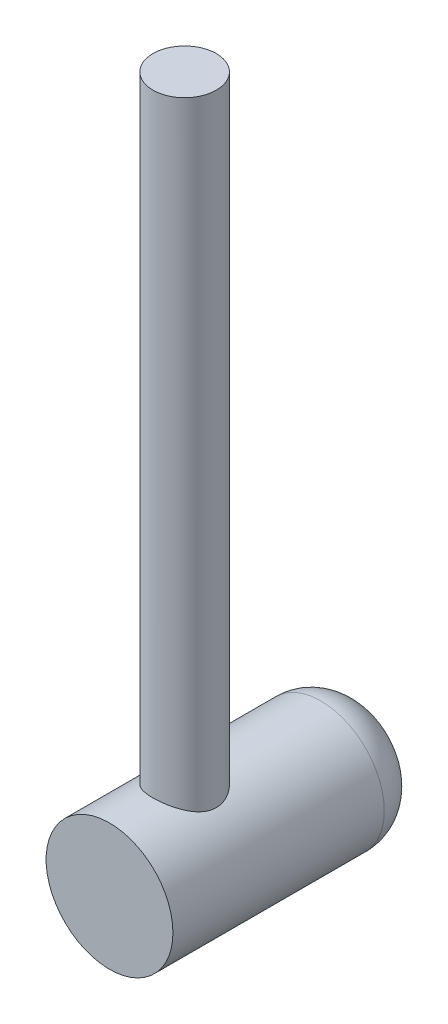
ISO-10303-21;
HEADER;
FILE_DESCRIPTION(('STEP AP214'),'2;1');
FILE_NAME('part.step','',(''),(''),'','','');
FILE_SCHEMA(('AUTOMOTIVE_DESIGN { 1 0 10303 214 1 1 1 1 }'));
ENDSEC;
DATA;
#1=APPLICATION_CONTEXT('core data for automotive mechanical design processes');
#2=APPLICATION_PROTOCOL_DEFINITION('international standard','automotive_design',2000,#1);
#3=PRODUCT_CONTEXT('',#1,'mechanical');
#4=PRODUCT('Part','Part','',(#3));
#5=PRODUCT_RELATED_PRODUCT_CATEGORY('part','',(#4));
#6=PRODUCT_DEFINITION_FORMATION('','',#4);
#7=PRODUCT_DEFINITION_CONTEXT('part definition',#1,'design');
#8=PRODUCT_DEFINITION('design','',#6,#7);
#9=PRODUCT_DEFINITION_SHAPE('','',#8);
#10=(LENGTH_UNIT() NAMED_UNIT(*) SI_UNIT(.MILLI.,.METRE.));
#11=(NAMED_UNIT(*) PLANE_ANGLE_UNIT() SI_UNIT($,.RADIAN.));
#12=(NAMED_UNIT(*) SI_UNIT($,.STERADIAN.) SOLID_ANGLE_UNIT());
#13=UNCERTAINTY_MEASURE_WITH_UNIT(LENGTH_MEASURE(1.E-05),#10,'distance_accuracy_value','');
#14=(GEOMETRIC_REPRESENTATION_CONTEXT(3) GLOBAL_UNCERTAINTY_ASSIGNED_CONTEXT((#13)) GLOBAL_UNIT_ASSIGNED_CONTEXT((#10,
#11,#12)) REPRESENTATION_CONTEXT('',''));
#15=CARTESIAN_POINT('',(0.,0.,0.));
#16=DIRECTION('',(0.,0.,1.));
#17=DIRECTION('',(1.,0.,0.));
#18=AXIS2_PLACEMENT_3D('',#15,#16,#17);
#19=CARTESIAN_POINT('',(0.,0.,3000.));
#20=DIRECTION('',(0.,0.,-1.));
#21=DIRECTION('',(-1.,0.,0.));
#22=AXIS2_PLACEMENT_3D('',#19,#20,#21);
#23=CYLINDRICAL_SURFACE('',#22,750.);
#24=CARTESIAN_POINT('',(0.,0.,500.));
#25=DIRECTION('',(0.,0.,1.));
#26=DIRECTION('',(1.,0.,0.));
#27=AXIS2_PLACEMENT_3D('',#24,#25,#26);
#28=CIRCLE('',#27,750.);
#29=CARTESIAN_POINT('',(750.,0.,500.));
#30=VERTEX_POINT('',#29);
#31=EDGE_CURVE('E58',#30,#30,#28,.T.);
#32=ORIENTED_EDGE('',*,*,#31,.T.);
#33=EDGE_LOOP('',(#32));
#34=FACE_BOUND('',#33,.T.);
#35=CARTESIAN_POINT('',(0.,0.,3000.));
#36=DIRECTION('',(0.,0.,1.));
#37=DIRECTION('',(1.,0.,0.));
#38=AXIS2_PLACEMENT_3D('',#35,#36,#37);
#39=CIRCLE('',#38,750.);
#40=CARTESIAN_POINT('',(750.,0.,3000.));
#41=VERTEX_POINT('',#40);
#42=EDGE_CURVE('E63',#41,#41,#39,.T.);
#43=ORIENTED_EDGE('',*,*,#42,.F.);
#44=EDGE_LOOP('',(#43));
#45=FACE_BOUND('',#44,.T.);
#46=CARTESIAN_POINT('',(0.,750.,1736.63545153968));
#47=CARTESIAN_POINT('',(-4.93069732081843,749.999997752163,1736.63545408549));
#48=CARTESIAN_POINT('',(-9.86148759707114,749.951347959688,1736.73272671617));
#49=CARTESIAN_POINT('',(-19.7140047015577,749.757053782446,1737.12154307044));
#50=CARTESIAN_POINT('',(-24.6357304138135,749.611398163406,1737.41310929524));
#51=CARTESIAN_POINT('',(-34.4620221164051,749.223968262609,1738.18978213098));
#52=CARTESIAN_POINT('',(-39.3665806885778,748.982156620643,1738.67496396909));
#53=CARTESIAN_POINT('',(-49.1471147245483,748.404007908838,1739.83737036177));
#54=CARTESIAN_POINT('',(-54.0230910441244,748.067673684001,1740.5145891363));
#55=CARTESIAN_POINT('',(-63.7457447260188,747.302013513661,1742.06035648772));
#56=CARTESIAN_POINT('',(-68.5923586921137,746.872531463636,1742.92922629074));
#57=CARTESIAN_POINT('',(-78.239199966597,745.923668083329,1744.85510765098));
#58=CARTESIAN_POINT('',(-83.0394268701726,745.404285969248,1745.91212084855));
#59=CARTESIAN_POINT('',(-92.5845066096782,744.278980362664,1748.211174411));
#60=CARTESIAN_POINT('',(-97.3293655958195,743.673066582924,1749.45319401048));
#61=CARTESIAN_POINT('',(-106.756269040175,742.378431089759,1752.11898125012));
#62=CARTESIAN_POINT('',(-111.438313661111,741.689709590894,1753.54274841936));
#63=CARTESIAN_POINT('',(-120.713852717281,740.236527433918,1756.56241515));
#64=CARTESIAN_POINT('',(-125.30762242963,739.472374423287,1758.15761769743));
#65=CARTESIAN_POINT('',(-134.418433173688,737.870637893333,1761.52080671211));
#66=CARTESIAN_POINT('',(-138.935474213349,737.033054381621,1763.28879316146));
#67=CARTESIAN_POINT('',(-147.886383807094,735.289336184398,1766.99349402166));
#68=CARTESIAN_POINT('',(-152.320251494869,734.383200785365,1768.93021018878));
#69=CARTESIAN_POINT('',(-161.098741795704,732.507570419064,1772.96815554796));
#70=CARTESIAN_POINT('',(-165.443364333312,731.538075398232,1775.06938487912));
#71=CARTESIAN_POINT('',(-174.036921182535,729.541366571546,1779.43165064721));
#72=CARTESIAN_POINT('',(-178.285874290465,728.514164244615,1781.69265532515));
#73=CARTESIAN_POINT('',(-186.683799094963,726.407530386726,1786.37054213032));
#74=CARTESIAN_POINT('',(-190.832771010748,725.328098970299,1788.78742391573));
#75=CARTESIAN_POINT('',(-199.026045761933,723.122833227482,1793.77285572693));
#76=CARTESIAN_POINT('',(-203.070346155594,721.996997820183,1796.34140928628));
#77=CARTESIAN_POINT('',(-211.049734348121,719.704968233692,1801.62592037966));
#78=CARTESIAN_POINT('',(-214.984821173653,718.538773695019,1804.34187922677));
#79=CARTESIAN_POINT('',(-222.976261433455,716.100606164879,1810.08571594043));
#80=CARTESIAN_POINT('',(-227.02554909631,714.826502040994,1813.12252386637));
#81=CARTESIAN_POINT('',(-234.991912545756,712.247380117121,1819.35242024083));
#82=CARTESIAN_POINT('',(-238.908987010395,710.942362008257,1822.54551025118));
#83=CARTESIAN_POINT('',(-246.606391109372,708.309137060611,1829.08318164248));
#84=CARTESIAN_POINT('',(-250.386723194384,706.980930638041,1832.42776030605));
#85=CARTESIAN_POINT('',(-257.806759609007,704.309040996532,1839.26415111721));
#86=CARTESIAN_POINT('',(-261.446452078727,702.965356484702,1842.75597563007));
#87=CARTESIAN_POINT('',(-268.583134355421,700.269704904258,1849.88451226743));
#88=CARTESIAN_POINT('',(-272.080026159367,698.917732856241,1853.52132061947));
#89=CARTESIAN_POINT('',(-278.924318543171,696.214594960345,1860.93310069173));
#90=CARTESIAN_POINT('',(-282.27172265388,694.863429094169,1864.70806914481));
#91=CARTESIAN_POINT('',(-288.813219092795,692.170092242133,1872.39209303145));
#92=CARTESIAN_POINT('',(-292.007302807242,690.827921765282,1876.30115597752));
#93=CARTESIAN_POINT('',(-298.237809093867,688.161094825082,1884.24876435215));
#94=CARTESIAN_POINT('',(-301.274231188973,686.836438414737,1888.28731017245));
#95=CARTESIAN_POINT('',(-307.414921340323,684.111255231639,1896.80820585297));
#96=CARTESIAN_POINT('',(-310.506124959166,682.712832052599,1901.30065545485));
#97=CARTESIAN_POINT('',(-316.495193110872,679.957101254256,1910.42517459059));
#98=CARTESIAN_POINT('',(-319.393049727864,678.599795319585,1915.05724982966));
#99=CARTESIAN_POINT('',(-324.990036396582,675.937187681263,1924.45534608614));
#100=CARTESIAN_POINT('',(-327.68914309734,674.631892096507,1929.22138275199));
#101=CARTESIAN_POINT('',(-332.882179781937,672.08468067949,1938.87980400854));
#102=CARTESIAN_POINT('',(-335.376133304022,670.842757582413,1943.77217401953));
#103=CARTESIAN_POINT('',(-340.152158658347,668.433736185544,1953.67434880921));
#104=CARTESIAN_POINT('',(-342.434330696792,667.266602580207,1958.68409662965));
#105=CARTESIAN_POINT('',(-346.782140383487,665.01739717047,1968.815516444));
#106=CARTESIAN_POINT('',(-348.847777066383,663.935325745296,1973.93718893678));
#107=CARTESIAN_POINT('',(-352.756332131144,661.866949843731,1984.28339069925));
#108=CARTESIAN_POINT('',(-354.599268941109,660.880637444744,1989.50791141672));
#109=CARTESIAN_POINT('',(-358.056701714514,659.013853599487,2000.05063108034));
#110=CARTESIAN_POINT('',(-359.671201611961,658.133380330556,2005.36882841147));
#111=CARTESIAN_POINT('',(-362.576605340908,656.536964587326,2015.7679213825));
#112=CARTESIAN_POINT('',(-363.881083319593,655.814333313807,2020.84399990214));
#113=CARTESIAN_POINT('',(-366.278761126797,654.47823003151,2031.06004069192));
#114=CARTESIAN_POINT('',(-367.371963655254,653.864756627787,2036.20000214479));
#115=CARTESIAN_POINT('',(-369.343173137777,652.753323462949,2046.53333577831));
#116=CARTESIAN_POINT('',(-370.221184641828,652.255361259486,2051.72670682726));
#117=CARTESIAN_POINT('',(-371.758727157815,651.38025135852,2062.15584913142));
#118=CARTESIAN_POINT('',(-372.418258056338,651.003103723731,2067.39162040866));
#119=CARTESIAN_POINT('',(-373.515770638446,650.374022567781,2077.88938040608));
#120=CARTESIAN_POINT('',(-373.953938195052,650.121983998915,2083.1513433716));
#121=CARTESIAN_POINT('',(-374.607774640519,649.745456195198,2093.6936824767));
#122=CARTESIAN_POINT('',(-374.823442186083,649.620967730404,2098.97405872725));
#123=CARTESIAN_POINT('',(-375.031371944455,649.500950230061,2109.54022802658));
#124=CARTESIAN_POINT('',(-375.023652581318,649.505410559333,2114.82602059269));
#125=CARTESIAN_POINT('',(-374.784880749157,649.643219638542,2125.39077711895));
#126=CARTESIAN_POINT('',(-374.553834561546,649.776564763393,2130.66974126698));
#127=CARTESIAN_POINT('',(-373.910408492857,650.14700216951,2140.5769512668));
#128=CARTESIAN_POINT('',(-373.523069505637,650.369751117174,2145.20738632542));
#129=CARTESIAN_POINT('',(-372.577374911563,650.91197350684,2154.4449728838));
#130=CARTESIAN_POINT('',(-372.019023795077,651.231444409154,2159.05212499168));
#131=CARTESIAN_POINT('',(-370.733073385365,651.964366717456,2168.23474866029));
#132=CARTESIAN_POINT('',(-370.005489841949,652.377809377773,2172.81022312834));
#133=CARTESIAN_POINT('',(-368.383189235493,653.295257898377,2181.92230404823));
#134=CARTESIAN_POINT('',(-367.488470913115,653.799264441049,2186.45891020692));
#135=CARTESIAN_POINT('',(-365.534196120111,654.893888905212,2195.48703696202));
#136=CARTESIAN_POINT('',(-364.474600666099,655.484527307954,2199.97854662781));
#137=CARTESIAN_POINT('',(-362.193558688759,656.747687728637,2208.90859006225));
#138=CARTESIAN_POINT('',(-360.972112533457,657.420209560387,2213.34712395134));
#139=CARTESIAN_POINT('',(-358.370381279891,658.842065443618,2222.16509601646));
#140=CARTESIAN_POINT('',(-356.990089872407,659.591402546019,2226.54453183745));
#141=CARTESIAN_POINT('',(-354.073938732526,661.16139310657,2235.23831480896));
#142=CARTESIAN_POINT('',(-352.538078342208,661.982046866325,2239.55266168412));
#143=CARTESIAN_POINT('',(-349.276740931599,663.708701847647,2248.21015185006));
#144=CARTESIAN_POINT('',(-347.547692568825,664.616240981566,2252.55164265864));
#145=CARTESIAN_POINT('',(-343.933855964013,666.493547142099,2261.1556011886));
#146=CARTESIAN_POINT('',(-342.049067122438,667.463314408264,2265.4180686057));
#147=CARTESIAN_POINT('',(-338.127496534681,669.458464250441,2273.85891392729));
#148=CARTESIAN_POINT('',(-336.090722972081,670.48384383121,2278.03729634395));
#149=CARTESIAN_POINT('',(-331.868525691163,672.583705521852,2286.3060948159));
#150=CARTESIAN_POINT('',(-329.683089883345,673.658191622824,2290.3965036813));
#151=CARTESIAN_POINT('',(-325.166695179043,675.849777603002,2298.48588582202));
#152=CARTESIAN_POINT('',(-322.835700296099,676.966887993414,2302.48483614957));
#153=CARTESIAN_POINT('',(-318.031925091397,679.236889736991,2310.38674291791));
#154=CARTESIAN_POINT('',(-315.559132107839,680.389784281256,2314.2896907416));
#155=CARTESIAN_POINT('',(-310.475295416759,682.724626013813,2321.99561348371));
#156=CARTESIAN_POINT('',(-307.864250441151,683.906573468532,2325.79858748467));
#157=CARTESIAN_POINT('',(-302.507206071613,686.292932105199,2333.30104924417));
#158=CARTESIAN_POINT('',(-299.761204904932,687.497343582099,2337.00053564233));
#159=CARTESIAN_POINT('',(-293.780600039855,690.075985348685,2344.75533668175));
#160=CARTESIAN_POINT('',(-290.528211398158,691.452371455944,2348.79623591804));
#161=CARTESIAN_POINT('',(-283.86053941354,694.216262432046,2356.73762752741));
#162=CARTESIAN_POINT('',(-280.445249415595,695.603767753214,2360.63811415276));
#163=CARTESIAN_POINT('',(-273.455973928243,698.380964867009,2368.29417244174));
#164=CARTESIAN_POINT('',(-269.88197285174,699.770656861405,2372.0497298038));
#165=CARTESIAN_POINT('',(-262.580374174224,702.543091555745,2379.41039031792));
#166=CARTESIAN_POINT('',(-258.8527905764,703.925834876406,2383.01550712663));
#167=CARTESIAN_POINT('',(-251.246259133196,706.676504370717,2390.07260147867));
#168=CARTESIAN_POINT('',(-247.367234184495,708.044422531453,2393.52449905091));
#169=CARTESIAN_POINT('',(-239.464265472201,710.756159277708,2400.26817481552));
#170=CARTESIAN_POINT('',(-235.440321857492,712.099977887984,2403.55995317239));
#171=CARTESIAN_POINT('',(-227.252287181212,714.755147743572,2409.97830419737));
#172=CARTESIAN_POINT('',(-223.088194572506,716.066498630188,2413.10487504074));
#173=CARTESIAN_POINT('',(-214.62498081129,718.648517007216,2419.18751870659));
#174=CARTESIAN_POINT('',(-210.325858525609,719.919184156029,2422.14359009764));
#175=CARTESIAN_POINT('',(-201.394557826346,722.469925413001,2428.01355301819));
#176=CARTESIAN_POINT('',(-196.756195874736,723.747676822969,2430.91905463126));
#177=CARTESIAN_POINT('',(-187.344225023733,726.240897844301,2436.53106781615));
#178=CARTESIAN_POINT('',(-182.570614952579,727.456366915807,2439.23757766321));
#179=CARTESIAN_POINT('',(-172.895189175491,729.816449716585,2444.44536505182));
#180=CARTESIAN_POINT('',(-167.99336590546,730.961059251935,2446.94663044852));
#181=CARTESIAN_POINT('',(-158.069781276324,733.171046826583,2451.7373492365));
#182=CARTESIAN_POINT('',(-153.048020426526,734.23642520225,2454.02680352702));
#183=CARTESIAN_POINT('',(-142.896404216031,736.279435825503,2458.3862456553));
#184=CARTESIAN_POINT('',(-137.766618163416,737.257122337598,2460.45636936258));
#185=CARTESIAN_POINT('',(-127.405347065931,739.118110743883,2464.37267732029));
#186=CARTESIAN_POINT('',(-122.173861449786,740.001412107705,2466.21886031236));
#187=CARTESIAN_POINT('',(-111.619968559018,741.666717080212,2469.68129072865));
#188=CARTESIAN_POINT('',(-106.29756964712,742.448729949798,2471.2975591755));
#189=CARTESIAN_POINT('',(-95.5724914943419,743.90535922776,2474.29493323566));
#190=CARTESIAN_POINT('',(-90.1698140346183,744.579978015031,2475.67604405802));
#191=CARTESIAN_POINT('',(-79.7465150479536,745.765165293429,2478.09376707284));
#192=CARTESIAN_POINT('',(-74.7313244429884,746.284694646494,2479.1494407764));
#193=CARTESIAN_POINT('',(-64.6529814739851,747.225270256353,2481.05566239419));
#194=CARTESIAN_POINT('',(-59.5898299620581,747.646318259442,2481.90621394569));
#195=CARTESIAN_POINT('',(-49.4257907827202,748.386968279916,2483.39945545779));
#196=CARTESIAN_POINT('',(-44.3249046370468,748.706574365609,2484.04215375431));
#197=CARTESIAN_POINT('',(-34.095595702381,749.242098028246,2485.11763188499));
#198=CARTESIAN_POINT('',(-28.9671728233904,749.458015266095,2485.55041103264));
#199=CARTESIAN_POINT('',(-18.6955681745369,749.784547871985,2486.2044685785));
#200=CARTESIAN_POINT('',(-13.5523931307551,749.895205337248,2486.42583152989));
#201=CARTESIAN_POINT('',(-3.26008103695331,750.010571940898,2486.65660834546));
#202=CARTESIAN_POINT('',(1.88905603084949,750.015280762457,2486.66602157584));
#203=CARTESIAN_POINT('',(12.1821468590536,749.918718201914,2486.47287071845));
#204=CARTESIAN_POINT('',(17.3261008123517,749.81745092156,2486.27031483484));
#205=CARTESIAN_POINT('',(27.5981151323287,749.509669763512,2485.65392245321));
#206=CARTESIAN_POINT('',(32.7261757534651,749.303157579673,2485.24008935559));
#207=CARTESIAN_POINT('',(42.5584365560043,748.80644618821,2484.24283874754));
#208=CARTESIAN_POINT('',(47.2646271161136,748.52399126425,2483.67508633203));
#209=CARTESIAN_POINT('',(56.6461774957841,747.872528607717,2482.36263391469));
#210=CARTESIAN_POINT('',(61.3215378069877,747.503522258806,2481.61793674161));
#211=CARTESIAN_POINT('',(70.6332141839462,746.681186345552,2479.95367975139));
#212=CARTESIAN_POINT('',(75.2695327768782,746.227862283653,2479.03413134469));
#213=CARTESIAN_POINT('',(84.4958212344744,745.239546564972,2477.02257376527));
#214=CARTESIAN_POINT('',(89.0857908816862,744.704554525222,2475.93056378381));
#215=CARTESIAN_POINT('',(98.2122689778073,743.555986096931,2473.57682748169));
#216=CARTESIAN_POINT('',(102.748774960609,742.942406098751,2472.31509336527));
#217=CARTESIAN_POINT('',(111.761181450627,741.640187966143,2469.62505116001));
#218=CARTESIAN_POINT('',(116.237082080972,740.951549984232,2468.19674340964));
#219=CARTESIAN_POINT('',(125.121906006194,739.503055489962,2465.17685567195));
#220=CARTESIAN_POINT('',(129.53082720625,738.74319675544,2463.58527059005));
#221=CARTESIAN_POINT('',(138.275446690209,737.156460965809,2460.24241081759));
#222=CARTESIAN_POINT('',(142.611144618722,736.329583585537,2458.49113535222));
#223=CARTESIAN_POINT('',(151.326174456467,734.5887921463,2454.78039830273));
#224=CARTESIAN_POINT('',(155.703222919642,733.673068126416,2452.81642304492));
#225=CARTESIAN_POINT('',(164.368038827932,731.780577473923,2448.72757208758));
#226=CARTESIAN_POINT('',(168.655805839748,730.803810545154,2446.6026956074));
#227=CARTESIAN_POINT('',(177.136678015911,728.794613032047,2442.19623701617));
#228=CARTESIAN_POINT('',(181.329783508721,727.762182640896,2439.91465544898));
#229=CARTESIAN_POINT('',(189.616381276505,725.647237595237,2435.19897623226));
#230=CARTESIAN_POINT('',(193.709873564596,724.564722947324,2432.76487860281));
#231=CARTESIAN_POINT('',(201.793934718377,722.355018308429,2427.74753099986));
#232=CARTESIAN_POINT('',(205.784470160917,721.227814103651,2425.16423345111));
#233=CARTESIAN_POINT('',(213.65694254124,718.934989648208,2419.85332326655));
#234=CARTESIAN_POINT('',(217.538879817024,717.769369517134,2417.12571107997));
#235=CARTESIAN_POINT('',(225.190308630956,715.405729937308,2411.53008254114));
#236=CARTESIAN_POINT('',(228.959795433428,714.207709128091,2408.66206028913));
#237=CARTESIAN_POINT('',(236.3823855127,711.785507767531,2402.78964376245));
#238=CARTESIAN_POINT('',(240.035486962114,710.561326805948,2399.78524734834));
#239=CARTESIAN_POINT('',(247.574785487134,707.971845677436,2393.34216209338));
#240=CARTESIAN_POINT('',(251.448612630033,706.604499277124,2389.88980821179));
#241=CARTESIAN_POINT('',(259.046871981922,703.85441901537,2382.8302373647));
#242=CARTESIAN_POINT('',(262.771301812067,702.471684909358,2379.22301793518));
#243=CARTESIAN_POINT('',(270.066286762243,699.699525821457,2371.85855593663));
#244=CARTESIAN_POINT('',(273.636839614062,698.310100741276,2368.10131115775));
#245=CARTESIAN_POINT('',(280.61982308594,695.533345221282,2360.44135231677));
#246=CARTESIAN_POINT('',(284.032241841715,694.146014946166,2356.53862737929));
#247=CARTESIAN_POINT('',(290.696350986521,691.381698450862,2348.59018483567));
#248=CARTESIAN_POINT('',(293.947937470887,690.004719392756,2344.54437761307));
#249=CARTESIAN_POINT('',(300.283542627016,687.271196341149,2336.31689693476));
#250=CARTESIAN_POINT('',(303.367560855802,685.914652401677,2332.13522311993));
#251=CARTESIAN_POINT('',(309.363611751244,683.231252940771,2323.64060492063));
#252=CARTESIAN_POINT('',(312.275632924517,681.904399407015,2319.32765179279));
#253=CARTESIAN_POINT('',(317.922474332799,679.290056065572,2310.57618847868));
#254=CARTESIAN_POINT('',(320.657309646967,678.002562913113,2306.13768902318));
#255=CARTESIAN_POINT('',(326.073892134866,675.414879347389,2296.92107204751));
#256=CARTESIAN_POINT('',(328.746576984702,674.117120849028,2292.13693919149));
#257=CARTESIAN_POINT('',(333.88623221836,671.586323512944,2282.44260335986));
#258=CARTESIAN_POINT('',(336.353200734316,670.353285262905,2277.53239924006));
#259=CARTESIAN_POINT('',(341.075626072542,667.962889865849,2267.59279480205));
#260=CARTESIAN_POINT('',(343.331069046398,666.805537675438,2262.56338670662));
#261=CARTESIAN_POINT('',(347.624226036463,664.577495188118,2252.39361511069));
#262=CARTESIAN_POINT('',(349.661941140328,663.506804458301,2247.25325216462));
#263=CARTESIAN_POINT('',(353.511614886304,661.463742425016,2236.8757543733));
#264=CARTESIAN_POINT('',(355.323808578912,660.491268956933,2231.63872692857));
#265=CARTESIAN_POINT('',(358.719073055048,658.653440007142,2221.07228421357));
#266=CARTESIAN_POINT('',(360.302142347169,657.788085222692,2215.74286834218));
#267=CARTESIAN_POINT('',(363.233359229919,656.174006299522,2205.00304064455));
#268=CARTESIAN_POINT('',(364.581535548597,655.425267899491,2199.59263881114));
#269=CARTESIAN_POINT('',(367.03801471067,654.052808922917,2188.70200098074));
#270=CARTESIAN_POINT('',(368.146324279354,653.429084841309,2183.22176694625));
#271=CARTESIAN_POINT('',(370.023868147764,652.367522281177,2172.73317933228));
#272=CARTESIAN_POINT('',(370.815440611761,651.917586439668,2167.73003621122));
#273=CARTESIAN_POINT('',(372.196096308802,651.130323655331,2157.68711497843));
#274=CARTESIAN_POINT('',(372.785183872397,650.792994304188,2152.64733765253));
#275=CARTESIAN_POINT('',(373.758688714634,650.234386769223,2142.54189621124));
#276=CARTESIAN_POINT('',(374.143116468979,650.013102645525,2137.47623343421));
#277=CARTESIAN_POINT('',(374.705896882326,649.688845957659,2127.32965733956));
#278=CARTESIAN_POINT('',(374.884248746165,649.585873850009,2122.24874396318));
#279=CARTESIAN_POINT('',(375.034159642448,649.49933534909,2112.0847430569));
#280=CARTESIAN_POINT('',(375.005795719319,649.515724469051,2107.001657043));
#281=CARTESIAN_POINT('',(374.7425657463,649.667632289998,2096.84260248635));
#282=CARTESIAN_POINT('',(374.507698913352,649.803151442726,2091.76663397067));
#283=CARTESIAN_POINT('',(373.832378035391,650.19189825261,2081.63314286965));
#284=CARTESIAN_POINT('',(373.39193202527,650.445121309406,2076.57561957119));
#285=CARTESIAN_POINT('',(372.307110986674,651.066667823218,2066.48968986845));
#286=CARTESIAN_POINT('',(371.662739843529,651.434989087298,2061.46128291129));
#287=CARTESIAN_POINT('',(370.24359860356,652.242498671699,2051.92232163917));
#288=CARTESIAN_POINT('',(369.487154989863,652.671561924245,2047.4081667148));
#289=CARTESIAN_POINT('',(367.811534812145,653.617319608568,2038.41950438762));
#290=CARTESIAN_POINT('',(366.892361479454,654.134012300276,2033.9449961994));
#291=CARTESIAN_POINT('',(364.893863796113,655.250927470625,2025.04285694167));
#292=CARTESIAN_POINT('',(363.814552911237,655.851142925675,2020.61522196415));
#293=CARTESIAN_POINT('',(361.498496206274,657.130570876873,2011.81286416927));
#294=CARTESIAN_POINT('',(360.261749402632,657.809783866543,2007.43814168264));
#295=CARTESIAN_POINT('',(357.633530250277,659.242366753172,1998.74667834857));
#296=CARTESIAN_POINT('',(356.242023936008,659.99575292497,1994.42995046331));
#297=CARTESIAN_POINT('',(353.307656274242,661.571215228191,1985.86101246969));
#298=CARTESIAN_POINT('',(351.764795444373,662.393291124695,1981.60880214075));
#299=CARTESIAN_POINT('',(348.530928269548,664.100545781114,1973.17392736659));
#300=CARTESIAN_POINT('',(346.839920164355,664.985725290782,1968.99126374841));
#301=CARTESIAN_POINT('',(343.312903309957,666.813463870418,1960.69987120878));
#302=CARTESIAN_POINT('',(341.47688176074,667.756028003912,1956.59114885335));
#303=CARTESIAN_POINT('',(337.535362067012,669.757483431382,1948.17941906721));
#304=CARTESIAN_POINT('',(335.420049761871,670.819936990161,1943.88185582667));
#305=CARTESIAN_POINT('',(331.031909246457,672.996191181386,1935.38063698583));
#306=CARTESIAN_POINT('',(328.759064135532,674.109997318805,1931.17699152552));
#307=CARTESIAN_POINT('',(324.060006934788,676.381491157529,1922.86869512501));
#308=CARTESIAN_POINT('',(321.633800737206,677.539177172257,1918.76404038989));
#309=CARTESIAN_POINT('',(316.631699772867,679.891171265053,1910.65771535178));
#310=CARTESIAN_POINT('',(314.055803907664,681.085479611831,1906.65604580484));
#311=CARTESIAN_POINT('',(308.756935006347,683.503942979322,1898.75807289713));
#312=CARTESIAN_POINT('',(306.03390266443,684.72810992432,1894.86181298745));
#313=CARTESIAN_POINT('',(300.445256173758,687.198648286527,1887.18009071072));
#314=CARTESIAN_POINT('',(297.57963974787,688.445020058153,1883.39463011473));
#315=CARTESIAN_POINT('',(291.709127846858,690.952945862838,1875.93797061527));
#316=CARTESIAN_POINT('',(288.704221593053,692.214501065227,1872.26678059128));
#317=CARTESIAN_POINT('',(282.558990163883,694.745607551154,1865.04286591182));
#318=CARTESIAN_POINT('',(279.418673429879,696.015158332054,1861.4901338962));
#319=CARTESIAN_POINT('',(272.615541022958,698.710048290504,1854.08148932206));
#320=CARTESIAN_POINT('',(268.935646798423,700.135544572993,1850.24129575778));
#321=CARTESIAN_POINT('',(261.414258931945,702.978484111705,1842.71934201285));
#322=CARTESIAN_POINT('',(257.572762153022,704.395927210995,1839.03758491054));
#323=CARTESIAN_POINT('',(249.732752801856,707.213478572504,1831.83752302141));
#324=CARTESIAN_POINT('',(245.734227293502,708.613585394002,1828.31923175334));
#325=CARTESIAN_POINT('',(237.585507038256,711.387130945775,1821.45185928989));
#326=CARTESIAN_POINT('',(233.435313072298,712.760569813307,1818.10277722348));
#327=CARTESIAN_POINT('',(224.985937380235,715.472589422336,1811.57739383296));
#328=CARTESIAN_POINT('',(220.686667496929,716.811148688953,1808.40119770049));
#329=CARTESIAN_POINT('',(211.947069166178,719.443720719995,1802.22947661413));
#330=CARTESIAN_POINT('',(207.506740574347,720.73773343882,1799.23395184517));
#331=CARTESIAN_POINT('',(198.491200354384,723.272540749647,1793.42956786334));
#332=CARTESIAN_POINT('',(193.915995005707,724.513337812626,1790.62069998004));
#333=CARTESIAN_POINT('',(184.636948024634,726.933412613674,1785.19544072355));
#334=CARTESIAN_POINT('',(179.933106376547,728.112690344239,1782.57904937382));
#335=CARTESIAN_POINT('',(170.369607836776,730.409853067034,1777.52670843585));
#336=CARTESIAN_POINT('',(165.509075561715,731.5272372414,1775.09218713911));
#337=CARTESIAN_POINT('',(155.67238730583,733.683487504451,1770.43063006302));
#338=CARTESIAN_POINT('',(150.696230852625,734.722353272278,1768.20359513154));
#339=CARTESIAN_POINT('',(140.635980650338,736.714204157665,1763.96272646866));
#340=CARTESIAN_POINT('',(135.551869475607,737.667175278204,1761.94892747594));
#341=CARTESIAN_POINT('',(125.285786149515,739.479979682336,1758.14083435459));
#342=CARTESIAN_POINT('',(120.103815187992,740.339814097486,1756.34653755909));
#343=CARTESIAN_POINT('',(109.665124490824,741.957805997051,1752.98722924647));
#344=CARTESIAN_POINT('',(104.408625960526,742.716214180299,1751.42165147596));
#345=CARTESIAN_POINT('',(93.8185779424551,744.128086892524,1748.51946814861));
#346=CARTESIAN_POINT('',(88.4850253665194,744.781547202623,1747.18287179664));
#347=CARTESIAN_POINT('',(77.7554766364814,745.978022782709,1744.74399766973));
#348=CARTESIAN_POINT('',(72.3595158912164,746.521097718104,1743.64159329492));
#349=CARTESIAN_POINT('',(61.5147932077059,747.492847787743,1741.67425060701));
#350=CARTESIAN_POINT('',(56.0660396680535,747.921540818643,1740.80927514421));
#351=CARTESIAN_POINT('',(48.5048949508692,748.432814533497,1739.77964953141));
#352=CARTESIAN_POINT('',(46.4094018500201,748.565685538758,1739.51231028958));
#353=CARTESIAN_POINT('',(42.2132866515346,748.814032195806,1739.01298583207));
#354=CARTESIAN_POINT('',(40.1126648605209,748.929508862842,1738.78099855302));
#355=CARTESIAN_POINT('',(33.8050998809427,749.249582482315,1738.13836167148));
#356=CARTESIAN_POINT('',(29.5912557539963,749.427904395999,1737.78087339466));
#357=CARTESIAN_POINT('',(21.1514254938732,749.713576686661,1737.20854501445));
#358=CARTESIAN_POINT('',(16.9254389178765,749.820924441442,1736.99371018149));
#359=CARTESIAN_POINT('',(8.46632543837825,749.96414626179,1736.70714393369));
#360=CARTESIAN_POINT('',(4.23319697742983,750.000001929856,1736.63544935401));
#361=CARTESIAN_POINT('',(0.,750.,1736.63545153968));
#362=B_SPLINE_CURVE_WITH_KNOTS('',3,(#46,#47,#48,#49,#50,#51,#52,#53,#54,#55,#56,#57,#58,#59,
#60,#61,#62,#63,#64,#65,#66,#67,#68,#69,#70,#71,#72,#73,#74,#75,#76,#77,#78,#79,#80,#81,#82,#83,
#84,#85,#86,#87,#88,#89,#90,#91,#92,#93,#94,#95,#96,#97,#98,#99,#100,#101,#102,#103,#104,#105,
#106,#107,#108,#109,#110,#111,#112,#113,#114,#115,#116,#117,#118,#119,#120,#121,#122,#123,#124,
#125,#126,#127,#128,#129,#130,#131,#132,#133,#134,#135,#136,#137,#138,#139,#140,#141,#142,#143,
#144,#145,#146,#147,#148,#149,#150,#151,#152,#153,#154,#155,#156,#157,#158,#159,#160,#161,#162,
#163,#164,#165,#166,#167,#168,#169,#170,#171,#172,#173,#174,#175,#176,#177,#178,#179,#180,#181,
#182,#183,#184,#185,#186,#187,#188,#189,#190,#191,#192,#193,#194,#195,#196,#197,#198,#199,#200,
#201,#202,#203,#204,#205,#206,#207,#208,#209,#210,#211,#212,#213,#214,#215,#216,#217,#218,#219,
#220,#221,#222,#223,#224,#225,#226,#227,#228,#229,#230,#231,#232,#233,#234,#235,#236,#237,#238,
#239,#240,#241,#242,#243,#244,#245,#246,#247,#248,#249,#250,#251,#252,#253,#254,#255,#256,#257,
#258,#259,#260,#261,#262,#263,#264,#265,#266,#267,#268,#269,#270,#271,#272,#273,#274,#275,#276,
#277,#278,#279,#280,#281,#282,#283,#284,#285,#286,#287,#288,#289,#290,#291,#292,#293,#294,#295,
#296,#297,#298,#299,#300,#301,#302,#303,#304,#305,#306,#307,#308,#309,#310,#311,#312,#313,#314,
#315,#316,#317,#318,#319,#320,#321,#322,#323,#324,#325,#326,#327,#328,#329,#330,#331,#332,#333,
#334,#335,#336,#337,#338,#339,#340,#341,#342,#343,#344,#345,#346,#347,#348,#349,#350,#351,#352,
#353,#354,#355,#356,#357,#358,#359,#360,#361),.UNSPECIFIED.,.T.,.F.,(4,2,2,2,2,2,2,2,2,2,2,2,2,
2,2,2,2,2,2,2,2,2,2,2,2,2,2,2,2,2,2,2,2,2,2,2,2,2,2,2,2,2,2,2,2,2,2,2,2,2,2,2,2,2,2,2,2,2,2,2,2,
2,2,2,2,2,2,2,2,2,2,2,2,2,2,2,2,2,2,2,2,2,2,2,2,2,2,2,2,2,2,2,2,2,2,2,2,2,2,2,2,2,2,2,2,2,2,2,2,
2,2,2,2,2,2,2,2,2,2,2,2,2,2,2,2,2,2,2,2,2,2,2,2,2,2,2,2,2,2,2,2,2,2,2,2,2,2,2,2,2,2,2,2,2,2,2,2,
4),(0.,14.7910556437805,29.5838245419721,44.3823466085547,59.1804233075069,74.0034941147422,
88.8266941640828,103.648231686415,118.469730805986,133.233099179346,147.996466022625,
162.759986551357,177.523519561477,192.284126191422,207.044700454546,221.805618737156,
236.566668530108,252.220720226763,267.874928396302,283.528855874568,299.184100552932,
314.849914684608,330.515358598885,346.181681592403,361.848051988326,378.731866394533,
395.616371621944,412.502857441612,429.387403080408,446.263918478239,463.140509111504,
480.015702272943,496.890604784413,512.756825219817,528.62284288367,544.488525048574,
560.354215449319,576.206561609304,592.059003473866,607.910137896415,623.760826494193,
637.712526707204,651.663860613596,665.61389664231,679.564037786874,693.517482314915,
707.470895115247,721.424862326476,735.378888553209,749.656518295342,763.934203003074,
778.211119486146,792.489198386759,806.770821329823,821.053721535986,835.33675277144,
849.619971675385,865.715606685298,881.811899815639,897.90977728243,914.006190227762,
930.110908034081,946.215609295362,962.320488398162,978.425502689459,995.281266541463,
1012.13717647293,1028.99408309291,1045.85091814411,1062.69724901226,1079.54367453846,
1096.38855869147,1113.23306966025,1128.68202549687,1144.13070736808,1159.5787695948,
1175.02688234104,1190.46881422288,1205.91079228214,1221.35217268998,1236.79330458582,
1251.03532368979,1265.2771151279,1279.51797749454,1293.75890664316,1308.00049012926,
1322.24204467735,1336.48404372516,1350.72611187664,1365.37445275349,1380.02286470479,
1394.67122582006,1409.31958500637,1423.97264117194,1438.62565172611,1453.27927850031,
1467.93313524027,1484.02697405073,1500.12106902087,1516.21540114368,1532.31093882298,
1548.41674262393,1564.5225889994,1580.62951040327,1596.73505924434,1613.62448185645,
1630.51405780462,1647.40473872944,1664.29533527323,1681.16817741152,1698.04112937282,
1714.9120162754,1731.78243009734,1747.03313462917,1762.28351297339,1777.53311063769,
1792.78276714378,1808.02674028645,1823.27077123456,1838.51420643229,1853.75735121842,
1867.54498272817,1881.33234048714,1895.11853954023,1908.90482472462,1922.6941416215,
1936.48341136084,1950.27284496189,1964.06349708846,1978.77878967167,1993.49566341202,
2008.21197206345,2022.92838871905,2037.65078197265,2052.37341042504,2067.09718006839,
2081.82003316916,2098.33457734691,2114.84944224798,2131.36567051818,2147.88181375903,
2164.40789634767,2180.93399585269,2197.45932716374,2213.98466049037,2230.62848184164,
2247.27237120286,2263.91896789521,2280.56536231845,2297.16981924083,2313.77494349116,
2330.37106834527,2346.96459497776,2353.31427010064,2359.66357447049,2372.35854010946,
2385.05397474799,2397.75267596006),.UNSPECIFIED.);
#363=CARTESIAN_POINT('',(0.,750.,1736.63545153968));
#364=VERTEX_POINT('',#363);
#365=EDGE_CURVE('E10',#364,#364,#362,.T.);
#366=ORIENTED_EDGE('',*,*,#365,.F.);
#367=EDGE_LOOP('',(#366));
#368=FACE_BOUND('',#367,.T.);
#369=ADVANCED_FACE('F41',(#34,#45,#368),#23,.T.);
#370=CARTESIAN_POINT('',(0.,0.,3000.));
#371=DIRECTION('',(0.,0.,1.));
#372=DIRECTION('',(1.,0.,0.));
#373=AXIS2_PLACEMENT_3D('',#370,#371,#372);
#374=PLANE('',#373);
#375=ORIENTED_EDGE('',*,*,#42,.T.);
#376=EDGE_LOOP('',(#375));
#377=FACE_BOUND('',#376,.T.);
#378=ADVANCED_FACE('F88',(#377),#374,.T.);
#379=CARTESIAN_POINT('',(0.,0.,0.));
#380=DIRECTION('',(0.,0.,1.));
#381=DIRECTION('',(1.,0.,0.));
#382=AXIS2_PLACEMENT_3D('',#379,#380,#381);
#383=PLANE('',#382);
#384=CARTESIAN_POINT('',(0.,0.,0.));
#385=DIRECTION('',(0.,0.,1.));
#386=DIRECTION('',(1.,0.,0.));
#387=AXIS2_PLACEMENT_3D('',#384,#385,#386);
#388=CIRCLE('',#387,250.);
#389=CARTESIAN_POINT('',(250.,0.,0.));
#390=VERTEX_POINT('',#389);
#391=EDGE_CURVE('E53',#390,#390,#388,.F.);
#392=ORIENTED_EDGE('',*,*,#391,.T.);
#393=EDGE_LOOP('',(#392));
#394=FACE_BOUND('',#393,.T.);
#395=ADVANCED_FACE('F83',(#394),#383,.F.);
#396=CARTESIAN_POINT('',(0.,0.,500.));
#397=DIRECTION('',(0.,0.,1.));
#398=DIRECTION('',(1.,0.,0.));
#399=AXIS2_PLACEMENT_3D('',#396,#397,#398);
#400=DEGENERATE_TOROIDAL_SURFACE('',#399,250.,500.,.T.);
#401=ORIENTED_EDGE('',*,*,#391,.F.);
#402=EDGE_LOOP('',(#401));
#403=FACE_BOUND('',#402,.T.);
#404=ORIENTED_EDGE('',*,*,#31,.F.);
#405=EDGE_LOOP('',(#404));
#406=FACE_BOUND('',#405,.T.);
#407=ADVANCED_FACE('F43',(#403,#406),#400,.T.);
#408=CARTESIAN_POINT('',(0.,8000.,2111.63545153968));
#409=DIRECTION('',(0.,-1.,0.));
#410=DIRECTION('',(0.,0.,-1.));
#411=AXIS2_PLACEMENT_3D('',#408,#409,#410);
#412=CYLINDRICAL_SURFACE('',#411,375.);
#413=CARTESIAN_POINT('',(0.,8000.,2111.63545153968));
#414=DIRECTION('',(0.,1.,0.));
#415=DIRECTION('',(0.,0.,1.));
#416=AXIS2_PLACEMENT_3D('',#413,#414,#415);
#417=CIRCLE('',#416,375.);
#418=CARTESIAN_POINT('',(0.,8000.,2486.63545153968));
#419=VERTEX_POINT('',#418);
#420=EDGE_CURVE('E69',#419,#419,#417,.T.);
#421=ORIENTED_EDGE('',*,*,#420,.F.);
#422=EDGE_LOOP('',(#421));
#423=FACE_BOUND('',#422,.T.);
#424=ORIENTED_EDGE('',*,*,#365,.T.);
#425=EDGE_LOOP('',(#424));
#426=FACE_BOUND('',#425,.T.);
#427=ADVANCED_FACE('F76',(#423,#426),#412,.T.);
#428=CARTESIAN_POINT('',(0.,8000.,2111.63545153968));
#429=DIRECTION('',(0.,1.,0.));
#430=DIRECTION('',(0.,0.,1.));
#431=AXIS2_PLACEMENT_3D('',#428,#429,#430);
#432=PLANE('',#431);
#433=ORIENTED_EDGE('',*,*,#420,.T.);
#434=EDGE_LOOP('',(#433));
#435=FACE_BOUND('',#434,.T.);
#436=ADVANCED_FACE('F74',(#435),#432,.T.);
#437=CLOSED_SHELL('',(#369,#378,#395,#407,#427,#436));
#438=MANIFOLD_SOLID_BREP('B2',#437);
#439=ADVANCED_BREP_SHAPE_REPRESENTATION('',(#18,#438),#14);
#440=SHAPE_DEFINITION_REPRESENTATION(#9,#439);
ENDSEC;
END-ISO-10303-21;
